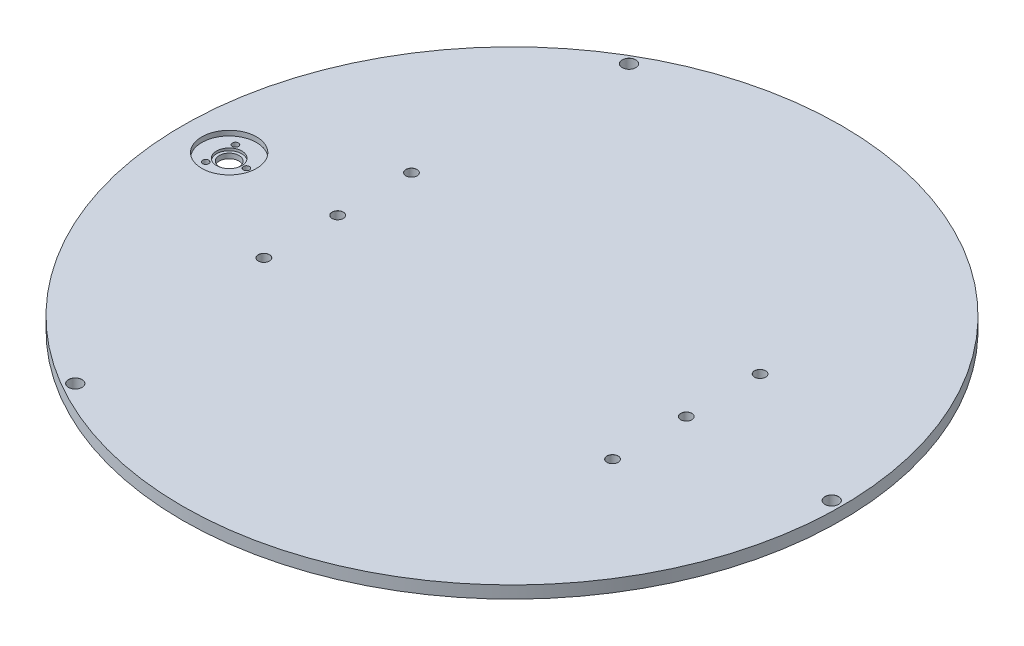
ISO-10303-21;
HEADER;
FILE_DESCRIPTION(('STEP AP214'),'2;1');
FILE_NAME('part.step','',(''),(''),'','','');
FILE_SCHEMA(('AUTOMOTIVE_DESIGN { 1 0 10303 214 1 1 1 1 }'));
ENDSEC;
DATA;
#1=APPLICATION_CONTEXT('core data for automotive mechanical design processes');
#2=APPLICATION_PROTOCOL_DEFINITION('international standard','automotive_design',2000,#1);
#3=PRODUCT_CONTEXT('',#1,'mechanical');
#4=PRODUCT('Part','Part','',(#3));
#5=PRODUCT_RELATED_PRODUCT_CATEGORY('part','',(#4));
#6=PRODUCT_DEFINITION_FORMATION('','',#4);
#7=PRODUCT_DEFINITION_CONTEXT('part definition',#1,'design');
#8=PRODUCT_DEFINITION('design','',#6,#7);
#9=PRODUCT_DEFINITION_SHAPE('','',#8);
#10=(LENGTH_UNIT() NAMED_UNIT(*) SI_UNIT(.MILLI.,.METRE.));
#11=(NAMED_UNIT(*) PLANE_ANGLE_UNIT() SI_UNIT($,.RADIAN.));
#12=(NAMED_UNIT(*) SI_UNIT($,.STERADIAN.) SOLID_ANGLE_UNIT());
#13=UNCERTAINTY_MEASURE_WITH_UNIT(LENGTH_MEASURE(1.E-05),#10,'distance_accuracy_value','');
#14=(GEOMETRIC_REPRESENTATION_CONTEXT(3) GLOBAL_UNCERTAINTY_ASSIGNED_CONTEXT((#13)) GLOBAL_UNIT_ASSIGNED_CONTEXT((#10,
#11,#12)) REPRESENTATION_CONTEXT('',''));
#15=CARTESIAN_POINT('',(0.,0.,0.));
#16=DIRECTION('',(0.,0.,1.));
#17=DIRECTION('',(1.,0.,0.));
#18=AXIS2_PLACEMENT_3D('',#15,#16,#17);
#19=CARTESIAN_POINT('',(0.,0.,0.));
#20=DIRECTION('',(0.,1.,0.));
#21=DIRECTION('',(0.,0.,1.));
#22=AXIS2_PLACEMENT_3D('',#19,#20,#21);
#23=PLANE('',#22);
#24=CARTESIAN_POINT('',(-70.875,0.,30.));
#25=DIRECTION('',(0.,1.,0.));
#26=DIRECTION('',(0.,0.,1.));
#27=AXIS2_PLACEMENT_3D('',#24,#25,#26);
#28=CIRCLE('',#27,2.25);
#29=CARTESIAN_POINT('',(-70.875,0.,32.25));
#30=VERTEX_POINT('',#29);
#31=EDGE_CURVE('E47',#30,#30,#28,.T.);
#32=ORIENTED_EDGE('',*,*,#31,.T.);
#33=EDGE_LOOP('',(#32));
#34=FACE_BOUND('',#33,.T.);
#35=CARTESIAN_POINT('',(-70.875,0.,0.));
#36=DIRECTION('',(0.,1.,0.));
#37=DIRECTION('',(0.,0.,1.));
#38=AXIS2_PLACEMENT_3D('',#35,#36,#37);
#39=CIRCLE('',#38,2.25);
#40=CARTESIAN_POINT('',(-70.875,0.,2.25));
#41=VERTEX_POINT('',#40);
#42=EDGE_CURVE('E109',#41,#41,#39,.T.);
#43=ORIENTED_EDGE('',*,*,#42,.T.);
#44=EDGE_LOOP('',(#43));
#45=FACE_BOUND('',#44,.T.);
#46=CARTESIAN_POINT('',(-70.875,0.,-30.));
#47=DIRECTION('',(0.,1.,0.));
#48=DIRECTION('',(0.,0.,1.));
#49=AXIS2_PLACEMENT_3D('',#46,#47,#48);
#50=CIRCLE('',#49,2.25);
#51=CARTESIAN_POINT('',(-70.875,0.,-27.75));
#52=VERTEX_POINT('',#51);
#53=EDGE_CURVE('E104',#52,#52,#50,.T.);
#54=ORIENTED_EDGE('',*,*,#53,.T.);
#55=EDGE_LOOP('',(#54));
#56=FACE_BOUND('',#55,.T.);
#57=CARTESIAN_POINT('',(70.875,0.,30.));
#58=DIRECTION('',(0.,1.,0.));
#59=DIRECTION('',(0.,0.,1.));
#60=AXIS2_PLACEMENT_3D('',#57,#58,#59);
#61=CIRCLE('',#60,2.25);
#62=CARTESIAN_POINT('',(70.875,0.,32.25));
#63=VERTEX_POINT('',#62);
#64=EDGE_CURVE('E98',#63,#63,#61,.T.);
#65=ORIENTED_EDGE('',*,*,#64,.T.);
#66=EDGE_LOOP('',(#65));
#67=FACE_BOUND('',#66,.T.);
#68=CARTESIAN_POINT('',(70.875,0.,0.));
#69=DIRECTION('',(0.,1.,0.));
#70=DIRECTION('',(0.,0.,1.));
#71=AXIS2_PLACEMENT_3D('',#68,#69,#70);
#72=CIRCLE('',#71,2.25);
#73=CARTESIAN_POINT('',(70.875,0.,2.25));
#74=VERTEX_POINT('',#73);
#75=EDGE_CURVE('E92',#74,#74,#72,.T.);
#76=ORIENTED_EDGE('',*,*,#75,.T.);
#77=EDGE_LOOP('',(#76));
#78=FACE_BOUND('',#77,.T.);
#79=CARTESIAN_POINT('',(70.875,0.,-30.));
#80=DIRECTION('',(0.,1.,0.));
#81=DIRECTION('',(0.,0.,1.));
#82=AXIS2_PLACEMENT_3D('',#79,#80,#81);
#83=CIRCLE('',#82,2.25);
#84=CARTESIAN_POINT('',(70.875,0.,-27.75));
#85=VERTEX_POINT('',#84);
#86=EDGE_CURVE('E86',#85,#85,#83,.T.);
#87=ORIENTED_EDGE('',*,*,#86,.T.);
#88=EDGE_LOOP('',(#87));
#89=FACE_BOUND('',#88,.T.);
#90=CARTESIAN_POINT('',(-65.,0.,-112.583302491977));
#91=DIRECTION('',(0.,1.,0.));
#92=DIRECTION('',(0.,0.,1.));
#93=AXIS2_PLACEMENT_3D('',#90,#91,#92);
#94=CIRCLE('',#93,2.75);
#95=CARTESIAN_POINT('',(-65.,0.,-109.833302491977));
#96=VERTEX_POINT('',#95);
#97=EDGE_CURVE('E80',#96,#96,#94,.T.);
#98=ORIENTED_EDGE('',*,*,#97,.T.);
#99=EDGE_LOOP('',(#98));
#100=FACE_BOUND('',#99,.T.);
#101=CARTESIAN_POINT('',(-65.,0.,112.583302491977));
#102=DIRECTION('',(0.,1.,0.));
#103=DIRECTION('',(0.,0.,1.));
#104=AXIS2_PLACEMENT_3D('',#101,#102,#103);
#105=CIRCLE('',#104,2.75);
#106=CARTESIAN_POINT('',(-65.,0.,115.333302491977));
#107=VERTEX_POINT('',#106);
#108=EDGE_CURVE('E74',#107,#107,#105,.T.);
#109=ORIENTED_EDGE('',*,*,#108,.T.);
#110=EDGE_LOOP('',(#109));
#111=FACE_BOUND('',#110,.T.);
#112=CARTESIAN_POINT('',(130.,0.,0.));
#113=DIRECTION('',(0.,1.,0.));
#114=DIRECTION('',(0.,0.,1.));
#115=AXIS2_PLACEMENT_3D('',#112,#113,#114);
#116=CIRCLE('',#115,2.75);
#117=CARTESIAN_POINT('',(130.,0.,2.75));
#118=VERTEX_POINT('',#117);
#119=EDGE_CURVE('E68',#118,#118,#116,.T.);
#120=ORIENTED_EDGE('',*,*,#119,.T.);
#121=EDGE_LOOP('',(#120));
#122=FACE_BOUND('',#121,.T.);
#123=CARTESIAN_POINT('',(-115.,0.,0.));
#124=DIRECTION('',(0.,-1.,0.));
#125=DIRECTION('',(0.,0.,-1.));
#126=AXIS2_PLACEMENT_3D('',#123,#124,#125);
#127=CIRCLE('',#126,3.99999999999999);
#128=CARTESIAN_POINT('',(-115.,0.,-3.99999999999999));
#129=VERTEX_POINT('',#128);
#130=EDGE_CURVE('E10',#129,#129,#127,.T.);
#131=ORIENTED_EDGE('',*,*,#130,.F.);
#132=EDGE_LOOP('',(#131));
#133=FACE_BOUND('',#132,.T.);
#134=CARTESIAN_POINT('',(-118.5,0.,6.06217782649109));
#135=DIRECTION('',(0.,1.,0.));
#136=DIRECTION('',(0.,0.,1.));
#137=AXIS2_PLACEMENT_3D('',#134,#135,#136);
#138=CIRCLE('',#137,1.25000000000001);
#139=CARTESIAN_POINT('',(-118.5,0.,7.3121778264911));
#140=VERTEX_POINT('',#139);
#141=EDGE_CURVE('E194',#140,#140,#138,.T.);
#142=ORIENTED_EDGE('',*,*,#141,.T.);
#143=EDGE_LOOP('',(#142));
#144=FACE_BOUND('',#143,.T.);
#145=CARTESIAN_POINT('',(-108.,0.,0.));
#146=DIRECTION('',(0.,1.,0.));
#147=DIRECTION('',(0.,0.,1.));
#148=AXIS2_PLACEMENT_3D('',#145,#146,#147);
#149=CIRCLE('',#148,1.25000000000001);
#150=CARTESIAN_POINT('',(-108.,0.,1.25000000000001));
#151=VERTEX_POINT('',#150);
#152=EDGE_CURVE('E186',#151,#151,#149,.T.);
#153=ORIENTED_EDGE('',*,*,#152,.T.);
#154=EDGE_LOOP('',(#153));
#155=FACE_BOUND('',#154,.T.);
#156=CARTESIAN_POINT('',(-118.5,0.,-6.06217782649109));
#157=DIRECTION('',(0.,1.,0.));
#158=DIRECTION('',(0.,0.,1.));
#159=AXIS2_PLACEMENT_3D('',#156,#157,#158);
#160=CIRCLE('',#159,1.25000000000001);
#161=CARTESIAN_POINT('',(-118.5,0.,-4.81217782649107));
#162=VERTEX_POINT('',#161);
#163=EDGE_CURVE('E177',#162,#162,#160,.T.);
#164=ORIENTED_EDGE('',*,*,#163,.T.);
#165=EDGE_LOOP('',(#164));
#166=FACE_BOUND('',#165,.T.);
#167=CARTESIAN_POINT('',(0.,0.,0.));
#168=DIRECTION('',(0.,1.,0.));
#169=DIRECTION('',(0.,0.,1.));
#170=AXIS2_PLACEMENT_3D('',#167,#168,#169);
#171=CIRCLE('',#170,134.);
#172=CARTESIAN_POINT('',(0.,0.,134.));
#173=VERTEX_POINT('',#172);
#174=EDGE_CURVE('E169',#173,#173,#171,.T.);
#175=ORIENTED_EDGE('',*,*,#174,.F.);
#176=EDGE_LOOP('',(#175));
#177=FACE_BOUND('',#176,.T.);
#178=ADVANCED_FACE('F44',(#34,#45,#56,#67,#78,#89,#100,#111,#122,#133,#144,#155,#166,#177),#23,.F.);
#179=CARTESIAN_POINT('',(76.99,5.,26.2747483337139));
#180=DIRECTION('',(0.,1.,0.));
#181=DIRECTION('',(0.,0.,1.));
#182=AXIS2_PLACEMENT_3D('',#179,#180,#181);
#183=PLANE('',#182);
#184=CARTESIAN_POINT('',(-70.875,5.,30.));
#185=DIRECTION('',(0.,1.,0.));
#186=DIRECTION('',(0.,0.,1.));
#187=AXIS2_PLACEMENT_3D('',#184,#185,#186);
#188=CIRCLE('',#187,2.275);
#189=CARTESIAN_POINT('',(-70.875,5.,32.275));
#190=VERTEX_POINT('',#189);
#191=EDGE_CURVE('E516',#190,#190,#188,.T.);
#192=ORIENTED_EDGE('',*,*,#191,.F.);
#193=EDGE_LOOP('',(#192));
#194=FACE_BOUND('',#193,.T.);
#195=CARTESIAN_POINT('',(-70.875,5.,0.));
#196=DIRECTION('',(0.,1.,0.));
#197=DIRECTION('',(0.,0.,1.));
#198=AXIS2_PLACEMENT_3D('',#195,#196,#197);
#199=CIRCLE('',#198,2.275);
#200=CARTESIAN_POINT('',(-70.875,5.,2.275));
#201=VERTEX_POINT('',#200);
#202=EDGE_CURVE('E121',#201,#201,#199,.T.);
#203=ORIENTED_EDGE('',*,*,#202,.F.);
#204=EDGE_LOOP('',(#203));
#205=FACE_BOUND('',#204,.T.);
#206=CARTESIAN_POINT('',(-70.875,5.,-30.));
#207=DIRECTION('',(0.,1.,0.));
#208=DIRECTION('',(0.,0.,1.));
#209=AXIS2_PLACEMENT_3D('',#206,#207,#208);
#210=CIRCLE('',#209,2.275);
#211=CARTESIAN_POINT('',(-70.875,5.,-27.725));
#212=VERTEX_POINT('',#211);
#213=EDGE_CURVE('E112',#212,#212,#210,.T.);
#214=ORIENTED_EDGE('',*,*,#213,.F.);
#215=EDGE_LOOP('',(#214));
#216=FACE_BOUND('',#215,.T.);
#217=CARTESIAN_POINT('',(70.875,5.,30.));
#218=DIRECTION('',(0.,1.,0.));
#219=DIRECTION('',(0.,0.,1.));
#220=AXIS2_PLACEMENT_3D('',#217,#218,#219);
#221=CIRCLE('',#220,2.275);
#222=CARTESIAN_POINT('',(70.875,5.,32.275));
#223=VERTEX_POINT('',#222);
#224=EDGE_CURVE('E107',#223,#223,#221,.T.);
#225=ORIENTED_EDGE('',*,*,#224,.F.);
#226=EDGE_LOOP('',(#225));
#227=FACE_BOUND('',#226,.T.);
#228=CARTESIAN_POINT('',(70.875,5.,0.));
#229=DIRECTION('',(0.,1.,0.));
#230=DIRECTION('',(0.,0.,1.));
#231=AXIS2_PLACEMENT_3D('',#228,#229,#230);
#232=CIRCLE('',#231,2.275);
#233=CARTESIAN_POINT('',(70.875,5.,2.275));
#234=VERTEX_POINT('',#233);
#235=EDGE_CURVE('E102',#234,#234,#232,.T.);
#236=ORIENTED_EDGE('',*,*,#235,.F.);
#237=EDGE_LOOP('',(#236));
#238=FACE_BOUND('',#237,.T.);
#239=CARTESIAN_POINT('',(70.875,5.,-30.));
#240=DIRECTION('',(0.,1.,0.));
#241=DIRECTION('',(0.,0.,1.));
#242=AXIS2_PLACEMENT_3D('',#239,#240,#241);
#243=CIRCLE('',#242,2.275);
#244=CARTESIAN_POINT('',(70.875,5.,-27.725));
#245=VERTEX_POINT('',#244);
#246=EDGE_CURVE('E96',#245,#245,#243,.T.);
#247=ORIENTED_EDGE('',*,*,#246,.F.);
#248=EDGE_LOOP('',(#247));
#249=FACE_BOUND('',#248,.T.);
#250=CARTESIAN_POINT('',(-65.,5.,-112.583302491977));
#251=DIRECTION('',(0.,1.,0.));
#252=DIRECTION('',(0.,0.,1.));
#253=AXIS2_PLACEMENT_3D('',#250,#251,#252);
#254=CIRCLE('',#253,2.775);
#255=CARTESIAN_POINT('',(-65.,5.,-109.808302491977));
#256=VERTEX_POINT('',#255);
#257=EDGE_CURVE('E90',#256,#256,#254,.T.);
#258=ORIENTED_EDGE('',*,*,#257,.F.);
#259=EDGE_LOOP('',(#258));
#260=FACE_BOUND('',#259,.T.);
#261=CARTESIAN_POINT('',(-65.,5.,112.583302491977));
#262=DIRECTION('',(0.,1.,0.));
#263=DIRECTION('',(0.,0.,1.));
#264=AXIS2_PLACEMENT_3D('',#261,#262,#263);
#265=CIRCLE('',#264,2.775);
#266=CARTESIAN_POINT('',(-65.,5.,115.358302491977));
#267=VERTEX_POINT('',#266);
#268=EDGE_CURVE('E84',#267,#267,#265,.T.);
#269=ORIENTED_EDGE('',*,*,#268,.F.);
#270=EDGE_LOOP('',(#269));
#271=FACE_BOUND('',#270,.T.);
#272=CARTESIAN_POINT('',(130.,5.,0.));
#273=DIRECTION('',(0.,1.,0.));
#274=DIRECTION('',(0.,0.,1.));
#275=AXIS2_PLACEMENT_3D('',#272,#273,#274);
#276=CIRCLE('',#275,2.775);
#277=CARTESIAN_POINT('',(130.,5.,2.775));
#278=VERTEX_POINT('',#277);
#279=EDGE_CURVE('E78',#278,#278,#276,.T.);
#280=ORIENTED_EDGE('',*,*,#279,.F.);
#281=EDGE_LOOP('',(#280));
#282=FACE_BOUND('',#281,.T.);
#283=CARTESIAN_POINT('',(-115.,5.,0.));
#284=DIRECTION('',(0.,1.,0.));
#285=DIRECTION('',(0.,0.,1.));
#286=AXIS2_PLACEMENT_3D('',#283,#284,#285);
#287=CIRCLE('',#286,11.125);
#288=CARTESIAN_POINT('',(-115.,5.,11.125));
#289=VERTEX_POINT('',#288);
#290=EDGE_CURVE('E181',#289,#289,#287,.T.);
#291=ORIENTED_EDGE('',*,*,#290,.F.);
#292=EDGE_LOOP('',(#291));
#293=FACE_BOUND('',#292,.T.);
#294=CARTESIAN_POINT('',(0.,5.,0.));
#295=DIRECTION('',(0.,1.,0.));
#296=DIRECTION('',(0.,0.,1.));
#297=AXIS2_PLACEMENT_3D('',#294,#295,#296);
#298=CIRCLE('',#297,134.);
#299=CARTESIAN_POINT('',(0.,5.,134.));
#300=VERTEX_POINT('',#299);
#301=EDGE_CURVE('E72',#300,#300,#298,.T.);
#302=ORIENTED_EDGE('',*,*,#301,.T.);
#303=EDGE_LOOP('',(#302));
#304=FACE_BOUND('',#303,.T.);
#305=ADVANCED_FACE('F209',(#194,#205,#216,#227,#238,#249,#260,#271,#282,#293,#304),#183,.T.);
#306=CARTESIAN_POINT('',(-115.,2.,0.));
#307=DIRECTION('',(0.,1.,0.));
#308=DIRECTION('',(0.,0.,1.));
#309=AXIS2_PLACEMENT_3D('',#306,#307,#308);
#310=CYLINDRICAL_SURFACE('',#309,5.14999999999998);
#311=CARTESIAN_POINT('',(-115.,2.,0.));
#312=DIRECTION('',(0.,1.,0.));
#313=DIRECTION('',(0.,0.,1.));
#314=AXIS2_PLACEMENT_3D('',#311,#312,#313);
#315=CIRCLE('',#314,5.14999999999998);
#316=CARTESIAN_POINT('',(-115.,2.,5.14999999999998));
#317=VERTEX_POINT('',#316);
#318=EDGE_CURVE('E58',#317,#317,#315,.T.);
#319=ORIENTED_EDGE('',*,*,#318,.F.);
#320=EDGE_LOOP('',(#319));
#321=FACE_BOUND('',#320,.T.);
#322=CARTESIAN_POINT('',(-115.,3.,0.));
#323=DIRECTION('',(0.,1.,0.));
#324=DIRECTION('',(0.,0.,1.));
#325=AXIS2_PLACEMENT_3D('',#322,#323,#324);
#326=CIRCLE('',#325,5.14999999999998);
#327=CARTESIAN_POINT('',(-115.,3.,5.14999999999998));
#328=VERTEX_POINT('',#327);
#329=EDGE_CURVE('E63',#328,#328,#326,.F.);
#330=ORIENTED_EDGE('',*,*,#329,.F.);
#331=EDGE_LOOP('',(#330));
#332=FACE_BOUND('',#331,.T.);
#333=ADVANCED_FACE('F212',(#321,#332),#310,.F.);
#334=CARTESIAN_POINT('',(-115.,34.4580685042316,0.));
#335=DIRECTION('',(0.,-1.,0.));
#336=DIRECTION('',(0.,0.,-1.));
#337=AXIS2_PLACEMENT_3D('',#334,#335,#336);
#338=CYLINDRICAL_SURFACE('',#337,3.99999999999999);
#339=CARTESIAN_POINT('',(-115.,2.,0.));
#340=DIRECTION('',(0.,1.,0.));
#341=DIRECTION('',(0.,0.,1.));
#342=AXIS2_PLACEMENT_3D('',#339,#340,#341);
#343=CIRCLE('',#342,3.99999999999999);
#344=CARTESIAN_POINT('',(-115.,1.99999999999999,-3.99999999999999));
#345=VERTEX_POINT('',#344);
#346=EDGE_CURVE('E52',#345,#345,#343,.F.);
#347=CARTESIAN_POINT('',(-115.,0.,-3.99999999999999));
#348=CARTESIAN_POINT('',(-115.,0.0208333333333403,-3.99999999999999));
#349=CARTESIAN_POINT('',(-115.,0.0416666666666736,-3.99999999999999));
#350=CARTESIAN_POINT('',(-115.,0.0833333333333404,-3.99999999999999));
#351=CARTESIAN_POINT('',(-115.,0.104166666666674,-3.99999999999999));
#352=CARTESIAN_POINT('',(-115.,0.14583333333334,-3.99999999999999));
#353=CARTESIAN_POINT('',(-115.,0.166666666666674,-3.99999999999999));
#354=CARTESIAN_POINT('',(-115.,0.20833333333334,-3.99999999999999));
#355=CARTESIAN_POINT('',(-115.,0.229166666666674,-3.99999999999999));
#356=CARTESIAN_POINT('',(-115.,0.270833333333341,-3.99999999999999));
#357=CARTESIAN_POINT('',(-115.,0.291666666666674,-3.99999999999999));
#358=CARTESIAN_POINT('',(-115.,0.333333333333341,-3.99999999999999));
#359=CARTESIAN_POINT('',(-115.,0.354166666666674,-3.99999999999999));
#360=CARTESIAN_POINT('',(-115.,0.395833333333341,-3.99999999999999));
#361=CARTESIAN_POINT('',(-115.,0.416666666666674,-3.99999999999999));
#362=CARTESIAN_POINT('',(-115.,0.458333333333341,-3.99999999999999));
#363=CARTESIAN_POINT('',(-115.,0.479166666666674,-3.99999999999999));
#364=CARTESIAN_POINT('',(-115.,0.520833333333338,-3.99999999999999));
#365=CARTESIAN_POINT('',(-115.,0.541666666666669,-3.99999999999999));
#366=CARTESIAN_POINT('',(-115.,0.583333333333334,-3.99999999999999));
#367=CARTESIAN_POINT('',(-115.,0.604166666666667,-3.99999999999999));
#368=CARTESIAN_POINT('',(-115.,0.645833333333334,-3.99999999999999));
#369=CARTESIAN_POINT('',(-115.,0.666666666666667,-3.99999999999999));
#370=CARTESIAN_POINT('',(-115.,0.708333333333334,-3.99999999999999));
#371=CARTESIAN_POINT('',(-115.,0.729166666666667,-3.99999999999999));
#372=CARTESIAN_POINT('',(-115.,0.770833333333334,-3.99999999999999));
#373=CARTESIAN_POINT('',(-115.,0.791666666666667,-3.99999999999999));
#374=CARTESIAN_POINT('',(-115.,0.833333333333334,-3.99999999999999));
#375=CARTESIAN_POINT('',(-115.,0.854166666666667,-3.99999999999999));
#376=CARTESIAN_POINT('',(-115.,0.895833333333334,-3.99999999999999));
#377=CARTESIAN_POINT('',(-115.,0.916666666666668,-3.99999999999999));
#378=CARTESIAN_POINT('',(-115.,0.958333333333334,-3.99999999999999));
#379=CARTESIAN_POINT('',(-115.,0.979166666666668,-3.99999999999999));
#380=CARTESIAN_POINT('',(-115.,1.02083333333333,-3.99999999999999));
#381=CARTESIAN_POINT('',(-115.,1.04166666666667,-3.99999999999999));
#382=CARTESIAN_POINT('',(-115.,1.08333333333333,-3.99999999999999));
#383=CARTESIAN_POINT('',(-115.,1.10416666666667,-3.99999999999999));
#384=CARTESIAN_POINT('',(-115.,1.14583333333333,-3.99999999999999));
#385=CARTESIAN_POINT('',(-115.,1.16666666666667,-3.99999999999999));
#386=CARTESIAN_POINT('',(-115.,1.20833333333333,-3.99999999999999));
#387=CARTESIAN_POINT('',(-115.,1.22916666666667,-3.99999999999999));
#388=CARTESIAN_POINT('',(-115.,1.27083333333333,-3.99999999999999));
#389=CARTESIAN_POINT('',(-115.,1.29166666666667,-3.99999999999999));
#390=CARTESIAN_POINT('',(-115.,1.33333333333333,-3.99999999999999));
#391=CARTESIAN_POINT('',(-115.,1.35416666666667,-3.99999999999999));
#392=CARTESIAN_POINT('',(-115.,1.39583333333333,-3.99999999999999));
#393=CARTESIAN_POINT('',(-115.,1.41666666666667,-3.99999999999999));
#394=CARTESIAN_POINT('',(-115.,1.45833333333333,-3.99999999999999));
#395=CARTESIAN_POINT('',(-115.,1.47916666666666,-3.99999999999999));
#396=CARTESIAN_POINT('',(-115.,1.52083333333333,-3.99999999999999));
#397=CARTESIAN_POINT('',(-115.,1.54166666666666,-3.99999999999999));
#398=CARTESIAN_POINT('',(-115.,1.58333333333333,-3.99999999999999));
#399=CARTESIAN_POINT('',(-115.,1.60416666666666,-3.99999999999999));
#400=CARTESIAN_POINT('',(-115.,1.64583333333333,-3.99999999999999));
#401=CARTESIAN_POINT('',(-115.,1.66666666666666,-3.99999999999999));
#402=CARTESIAN_POINT('',(-115.,1.70833333333333,-3.99999999999999));
#403=CARTESIAN_POINT('',(-115.,1.72916666666666,-3.99999999999999));
#404=CARTESIAN_POINT('',(-115.,1.77083333333333,-3.99999999999999));
#405=CARTESIAN_POINT('',(-115.,1.79166666666666,-3.99999999999999));
#406=CARTESIAN_POINT('',(-115.,1.83333333333333,-3.99999999999999));
#407=CARTESIAN_POINT('',(-115.,1.85416666666666,-3.99999999999999));
#408=CARTESIAN_POINT('',(-115.,1.89583333333333,-3.99999999999999));
#409=CARTESIAN_POINT('',(-115.,1.91666666666666,-3.99999999999999));
#410=CARTESIAN_POINT('',(-115.,1.95833333333333,-3.99999999999999));
#411=CARTESIAN_POINT('',(-115.,1.97916666666666,-3.99999999999999));
#412=CARTESIAN_POINT('',(-115.,1.99999999999999,-3.99999999999999));
#413=B_SPLINE_CURVE_WITH_KNOTS('',3,(#347,#348,#349,#350,#351,#352,#353,#354,#355,#356,#357,
#358,#359,#360,#361,#362,#363,#364,#365,#366,#367,#368,#369,#370,#371,#372,#373,#374,#375,#376,
#377,#378,#379,#380,#381,#382,#383,#384,#385,#386,#387,#388,#389,#390,#391,#392,#393,#394,#395,
#396,#397,#398,#399,#400,#401,#402,#403,#404,#405,#406,#407,#408,#409,#410,#411,#412),
.UNSPECIFIED.,.F.,.F.,(4,2,2,2,2,2,2,2,2,2,2,2,2,2,2,2,2,2,2,2,2,2,2,2,2,2,2,2,2,2,2,2,4),(0.,
0.0625000000000001,0.125,0.1875,0.25,0.3125,0.375,0.4375,0.5,0.562499999999994,
0.624999999999994,0.687499999999994,0.749999999999994,0.812499999999994,0.874999999999994,
0.937499999999994,0.999999999999994,1.06249999999999,1.12499999999999,1.18749999999999,
1.24999999999999,1.31249999999999,1.37499999999999,1.43749999999999,1.49999999999999,
1.56249999999999,1.62499999999999,1.68749999999999,1.74999999999999,1.81249999999999,
1.87499999999999,1.93749999999999,1.99999999999999),.UNSPECIFIED.);
#414=EDGE_CURVE('BSEAM279',#129,#345,#413,.T.);
#415=ORIENTED_EDGE('',*,*,#130,.T.);
#416=ORIENTED_EDGE('',*,*,#346,.F.);
#417=ORIENTED_EDGE('',*,*,#414,.T.);
#418=ORIENTED_EDGE('',*,*,#414,.F.);
#419=EDGE_LOOP('',(#415,#417,#416,#418));
#420=FACE_BOUND('',#419,.T.);
#421=ADVANCED_FACE('F279',(#420),#338,.F.);
#422=CARTESIAN_POINT('',(-115.,2.,0.));
#423=DIRECTION('',(0.,1.,0.));
#424=DIRECTION('',(0.,0.,1.));
#425=AXIS2_PLACEMENT_3D('',#422,#423,#424);
#426=PLANE('',#425);
#427=ORIENTED_EDGE('',*,*,#318,.T.);
#428=EDGE_LOOP('',(#427));
#429=FACE_BOUND('',#428,.T.);
#430=ORIENTED_EDGE('',*,*,#346,.T.);
#431=EDGE_LOOP('',(#430));
#432=FACE_BOUND('',#431,.T.);
#433=ADVANCED_FACE('F268',(#429,#432),#426,.T.);
#434=CARTESIAN_POINT('',(-115.,3.,0.));
#435=DIRECTION('',(0.,1.,0.));
#436=DIRECTION('',(0.,0.,1.));
#437=AXIS2_PLACEMENT_3D('',#434,#435,#436);
#438=PLANE('',#437);
#439=CARTESIAN_POINT('',(-118.5,3.,-6.06217782649109));
#440=DIRECTION('',(0.,1.,0.));
#441=DIRECTION('',(0.,0.,1.));
#442=AXIS2_PLACEMENT_3D('',#439,#440,#441);
#443=CIRCLE('',#442,1.25000000000001);
#444=CARTESIAN_POINT('',(-118.5,3.,-4.81217782649107));
#445=VERTEX_POINT('',#444);
#446=EDGE_CURVE('E182',#445,#445,#443,.T.);
#447=ORIENTED_EDGE('',*,*,#446,.F.);
#448=EDGE_LOOP('',(#447));
#449=FACE_BOUND('',#448,.T.);
#450=CARTESIAN_POINT('',(-108.,3.,0.));
#451=DIRECTION('',(0.,1.,0.));
#452=DIRECTION('',(0.,0.,1.));
#453=AXIS2_PLACEMENT_3D('',#450,#451,#452);
#454=CIRCLE('',#453,1.25000000000001);
#455=CARTESIAN_POINT('',(-108.,3.,1.25000000000001));
#456=VERTEX_POINT('',#455);
#457=EDGE_CURVE('E190',#456,#456,#454,.T.);
#458=ORIENTED_EDGE('',*,*,#457,.F.);
#459=EDGE_LOOP('',(#458));
#460=FACE_BOUND('',#459,.T.);
#461=CARTESIAN_POINT('',(-118.5,3.,6.06217782649109));
#462=DIRECTION('',(0.,1.,0.));
#463=DIRECTION('',(0.,0.,1.));
#464=AXIS2_PLACEMENT_3D('',#461,#462,#463);
#465=CIRCLE('',#464,1.25000000000001);
#466=CARTESIAN_POINT('',(-118.5,3.,7.3121778264911));
#467=VERTEX_POINT('',#466);
#468=EDGE_CURVE('E173',#467,#467,#465,.T.);
#469=ORIENTED_EDGE('',*,*,#468,.F.);
#470=EDGE_LOOP('',(#469));
#471=FACE_BOUND('',#470,.T.);
#472=CARTESIAN_POINT('',(-115.,3.,0.));
#473=DIRECTION('',(0.,1.,0.));
#474=DIRECTION('',(0.,0.,1.));
#475=AXIS2_PLACEMENT_3D('',#472,#473,#474);
#476=CIRCLE('',#475,11.125);
#477=CARTESIAN_POINT('',(-115.,3.,11.125));
#478=VERTEX_POINT('',#477);
#479=EDGE_CURVE('E67',#478,#478,#476,.T.);
#480=ORIENTED_EDGE('',*,*,#479,.T.);
#481=EDGE_LOOP('',(#480));
#482=FACE_BOUND('',#481,.T.);
#483=ORIENTED_EDGE('',*,*,#329,.T.);
#484=EDGE_LOOP('',(#483));
#485=FACE_BOUND('',#484,.T.);
#486=ADVANCED_FACE('F265',(#449,#460,#471,#482,#485),#438,.T.);
#487=CARTESIAN_POINT('',(-115.,3.,0.));
#488=DIRECTION('',(0.,1.,0.));
#489=DIRECTION('',(0.,0.,1.));
#490=AXIS2_PLACEMENT_3D('',#487,#488,#489);
#491=CYLINDRICAL_SURFACE('',#490,11.125);
#492=ORIENTED_EDGE('',*,*,#479,.F.);
#493=EDGE_LOOP('',(#492));
#494=FACE_BOUND('',#493,.T.);
#495=ORIENTED_EDGE('',*,*,#290,.T.);
#496=EDGE_LOOP('',(#495));
#497=FACE_BOUND('',#496,.T.);
#498=ADVANCED_FACE('F207',(#494,#497),#491,.F.);
#499=CARTESIAN_POINT('',(-118.5,0.,6.06217782649109));
#500=DIRECTION('',(0.,1.,0.));
#501=DIRECTION('',(0.,0.,1.));
#502=AXIS2_PLACEMENT_3D('',#499,#500,#501);
#503=CYLINDRICAL_SURFACE('',#502,1.25000000000001);
#504=ORIENTED_EDGE('',*,*,#141,.F.);
#505=EDGE_LOOP('',(#504));
#506=FACE_BOUND('',#505,.T.);
#507=ORIENTED_EDGE('',*,*,#468,.T.);
#508=EDGE_LOOP('',(#507));
#509=FACE_BOUND('',#508,.T.);
#510=ADVANCED_FACE('F292',(#506,#509),#503,.F.);
#511=CARTESIAN_POINT('',(-108.,0.,0.));
#512=DIRECTION('',(0.,1.,0.));
#513=DIRECTION('',(0.,0.,1.));
#514=AXIS2_PLACEMENT_3D('',#511,#512,#513);
#515=CYLINDRICAL_SURFACE('',#514,1.25000000000001);
#516=ORIENTED_EDGE('',*,*,#152,.F.);
#517=EDGE_LOOP('',(#516));
#518=FACE_BOUND('',#517,.T.);
#519=ORIENTED_EDGE('',*,*,#457,.T.);
#520=EDGE_LOOP('',(#519));
#521=FACE_BOUND('',#520,.T.);
#522=ADVANCED_FACE('F229',(#518,#521),#515,.F.);
#523=CARTESIAN_POINT('',(-118.5,0.,-6.06217782649109));
#524=DIRECTION('',(0.,1.,0.));
#525=DIRECTION('',(0.,0.,1.));
#526=AXIS2_PLACEMENT_3D('',#523,#524,#525);
#527=CYLINDRICAL_SURFACE('',#526,1.25000000000001);
#528=ORIENTED_EDGE('',*,*,#163,.F.);
#529=EDGE_LOOP('',(#528));
#530=FACE_BOUND('',#529,.T.);
#531=ORIENTED_EDGE('',*,*,#446,.T.);
#532=EDGE_LOOP('',(#531));
#533=FACE_BOUND('',#532,.T.);
#534=ADVANCED_FACE('F219',(#530,#533),#527,.F.);
#535=CARTESIAN_POINT('',(0.,0.,0.));
#536=DIRECTION('',(0.,1.,0.));
#537=DIRECTION('',(0.,0.,1.));
#538=AXIS2_PLACEMENT_3D('',#535,#536,#537);
#539=CYLINDRICAL_SURFACE('',#538,134.);
#540=ORIENTED_EDGE('',*,*,#174,.T.);
#541=EDGE_LOOP('',(#540));
#542=FACE_BOUND('',#541,.T.);
#543=ORIENTED_EDGE('',*,*,#301,.F.);
#544=EDGE_LOOP('',(#543));
#545=FACE_BOUND('',#544,.T.);
#546=ADVANCED_FACE('F216',(#542,#545),#539,.T.);
#547=CARTESIAN_POINT('',(130.,5.,0.));
#548=DIRECTION('',(0.,1.,0.));
#549=DIRECTION('',(0.,0.,1.));
#550=AXIS2_PLACEMENT_3D('',#547,#548,#549);
#551=CYLINDRICAL_SURFACE('',#550,2.75);
#552=CARTESIAN_POINT('',(130.,4.975,0.));
#553=DIRECTION('',(0.,1.,0.));
#554=DIRECTION('',(0.,0.,1.));
#555=AXIS2_PLACEMENT_3D('',#552,#553,#554);
#556=CIRCLE('',#555,2.75);
#557=CARTESIAN_POINT('',(130.,4.975,2.75));
#558=VERTEX_POINT('',#557);
#559=EDGE_CURVE('E73',#558,#558,#556,.T.);
#560=ORIENTED_EDGE('',*,*,#559,.T.);
#561=EDGE_LOOP('',(#560));
#562=FACE_BOUND('',#561,.T.);
#563=ORIENTED_EDGE('',*,*,#119,.F.);
#564=EDGE_LOOP('',(#563));
#565=FACE_BOUND('',#564,.T.);
#566=ADVANCED_FACE('F218',(#562,#565),#551,.F.);
#567=CARTESIAN_POINT('',(130.,5.,0.));
#568=DIRECTION('',(0.,1.,0.));
#569=DIRECTION('',(0.,0.,1.));
#570=AXIS2_PLACEMENT_3D('',#567,#568,#569);
#571=CONICAL_SURFACE('',#570,2.775,0.785398163397344);
#572=ORIENTED_EDGE('',*,*,#559,.F.);
#573=EDGE_LOOP('',(#572));
#574=FACE_BOUND('',#573,.T.);
#575=ORIENTED_EDGE('',*,*,#279,.T.);
#576=EDGE_LOOP('',(#575));
#577=FACE_BOUND('',#576,.T.);
#578=ADVANCED_FACE('F226',(#574,#577),#571,.F.);
#579=CARTESIAN_POINT('',(-65.,5.,112.583302491977));
#580=DIRECTION('',(0.,1.,0.));
#581=DIRECTION('',(0.,0.,1.));
#582=AXIS2_PLACEMENT_3D('',#579,#580,#581);
#583=CYLINDRICAL_SURFACE('',#582,2.75);
#584=CARTESIAN_POINT('',(-65.,4.975,112.583302491977));
#585=DIRECTION('',(0.,1.,0.));
#586=DIRECTION('',(0.,0.,1.));
#587=AXIS2_PLACEMENT_3D('',#584,#585,#586);
#588=CIRCLE('',#587,2.75);
#589=CARTESIAN_POINT('',(-65.,4.975,115.333302491977));
#590=VERTEX_POINT('',#589);
#591=EDGE_CURVE('E79',#590,#590,#588,.T.);
#592=ORIENTED_EDGE('',*,*,#591,.T.);
#593=EDGE_LOOP('',(#592));
#594=FACE_BOUND('',#593,.T.);
#595=ORIENTED_EDGE('',*,*,#108,.F.);
#596=EDGE_LOOP('',(#595));
#597=FACE_BOUND('',#596,.T.);
#598=ADVANCED_FACE('F349',(#594,#597),#583,.F.);
#599=CARTESIAN_POINT('',(-65.,5.,112.583302491977));
#600=DIRECTION('',(0.,1.,0.));
#601=DIRECTION('',(0.,0.,1.));
#602=AXIS2_PLACEMENT_3D('',#599,#600,#601);
#603=CONICAL_SURFACE('',#602,2.775,0.785398163397344);
#604=ORIENTED_EDGE('',*,*,#591,.F.);
#605=EDGE_LOOP('',(#604));
#606=FACE_BOUND('',#605,.T.);
#607=ORIENTED_EDGE('',*,*,#268,.T.);
#608=EDGE_LOOP('',(#607));
#609=FACE_BOUND('',#608,.T.);
#610=ADVANCED_FACE('F359',(#606,#609),#603,.F.);
#611=CARTESIAN_POINT('',(-65.,5.,-112.583302491977));
#612=DIRECTION('',(0.,1.,0.));
#613=DIRECTION('',(0.,0.,1.));
#614=AXIS2_PLACEMENT_3D('',#611,#612,#613);
#615=CYLINDRICAL_SURFACE('',#614,2.75);
#616=CARTESIAN_POINT('',(-65.,4.975,-112.583302491977));
#617=DIRECTION('',(0.,1.,0.));
#618=DIRECTION('',(0.,0.,1.));
#619=AXIS2_PLACEMENT_3D('',#616,#617,#618);
#620=CIRCLE('',#619,2.75);
#621=CARTESIAN_POINT('',(-65.,4.975,-109.833302491977));
#622=VERTEX_POINT('',#621);
#623=EDGE_CURVE('E85',#622,#622,#620,.T.);
#624=ORIENTED_EDGE('',*,*,#623,.T.);
#625=EDGE_LOOP('',(#624));
#626=FACE_BOUND('',#625,.T.);
#627=ORIENTED_EDGE('',*,*,#97,.F.);
#628=EDGE_LOOP('',(#627));
#629=FACE_BOUND('',#628,.T.);
#630=ADVANCED_FACE('F369',(#626,#629),#615,.F.);
#631=CARTESIAN_POINT('',(-65.,5.,-112.583302491977));
#632=DIRECTION('',(0.,1.,0.));
#633=DIRECTION('',(0.,0.,1.));
#634=AXIS2_PLACEMENT_3D('',#631,#632,#633);
#635=CONICAL_SURFACE('',#634,2.775,0.785398163397344);
#636=ORIENTED_EDGE('',*,*,#623,.F.);
#637=EDGE_LOOP('',(#636));
#638=FACE_BOUND('',#637,.T.);
#639=ORIENTED_EDGE('',*,*,#257,.T.);
#640=EDGE_LOOP('',(#639));
#641=FACE_BOUND('',#640,.T.);
#642=ADVANCED_FACE('F379',(#638,#641),#635,.F.);
#643=CARTESIAN_POINT('',(70.875,5.,-30.));
#644=DIRECTION('',(0.,1.,0.));
#645=DIRECTION('',(0.,0.,1.));
#646=AXIS2_PLACEMENT_3D('',#643,#644,#645);
#647=CYLINDRICAL_SURFACE('',#646,2.25);
#648=CARTESIAN_POINT('',(70.875,4.975,-30.));
#649=DIRECTION('',(0.,1.,0.));
#650=DIRECTION('',(0.,0.,1.));
#651=AXIS2_PLACEMENT_3D('',#648,#649,#650);
#652=CIRCLE('',#651,2.25);
#653=CARTESIAN_POINT('',(70.875,4.975,-27.75));
#654=VERTEX_POINT('',#653);
#655=EDGE_CURVE('E91',#654,#654,#652,.T.);
#656=ORIENTED_EDGE('',*,*,#655,.T.);
#657=EDGE_LOOP('',(#656));
#658=FACE_BOUND('',#657,.T.);
#659=ORIENTED_EDGE('',*,*,#86,.F.);
#660=EDGE_LOOP('',(#659));
#661=FACE_BOUND('',#660,.T.);
#662=ADVANCED_FACE('F388',(#658,#661),#647,.F.);
#663=CARTESIAN_POINT('',(70.875,5.,-30.));
#664=DIRECTION('',(0.,1.,0.));
#665=DIRECTION('',(0.,0.,1.));
#666=AXIS2_PLACEMENT_3D('',#663,#664,#665);
#667=CONICAL_SURFACE('',#666,2.275,0.785398163397431);
#668=ORIENTED_EDGE('',*,*,#655,.F.);
#669=EDGE_LOOP('',(#668));
#670=FACE_BOUND('',#669,.T.);
#671=ORIENTED_EDGE('',*,*,#246,.T.);
#672=EDGE_LOOP('',(#671));
#673=FACE_BOUND('',#672,.T.);
#674=ADVANCED_FACE('F398',(#670,#673),#667,.F.);
#675=CARTESIAN_POINT('',(70.875,5.,0.));
#676=DIRECTION('',(0.,1.,0.));
#677=DIRECTION('',(0.,0.,1.));
#678=AXIS2_PLACEMENT_3D('',#675,#676,#677);
#679=CYLINDRICAL_SURFACE('',#678,2.25);
#680=CARTESIAN_POINT('',(70.875,4.975,0.));
#681=DIRECTION('',(0.,1.,0.));
#682=DIRECTION('',(0.,0.,1.));
#683=AXIS2_PLACEMENT_3D('',#680,#681,#682);
#684=CIRCLE('',#683,2.25);
#685=CARTESIAN_POINT('',(70.875,4.975,2.25));
#686=VERTEX_POINT('',#685);
#687=EDGE_CURVE('E97',#686,#686,#684,.T.);
#688=ORIENTED_EDGE('',*,*,#687,.T.);
#689=EDGE_LOOP('',(#688));
#690=FACE_BOUND('',#689,.T.);
#691=ORIENTED_EDGE('',*,*,#75,.F.);
#692=EDGE_LOOP('',(#691));
#693=FACE_BOUND('',#692,.T.);
#694=ADVANCED_FACE('F408',(#690,#693),#679,.F.);
#695=CARTESIAN_POINT('',(70.875,5.,0.));
#696=DIRECTION('',(0.,1.,0.));
#697=DIRECTION('',(0.,0.,1.));
#698=AXIS2_PLACEMENT_3D('',#695,#696,#697);
#699=CONICAL_SURFACE('',#698,2.275,0.785398163397431);
#700=ORIENTED_EDGE('',*,*,#687,.F.);
#701=EDGE_LOOP('',(#700));
#702=FACE_BOUND('',#701,.T.);
#703=ORIENTED_EDGE('',*,*,#235,.T.);
#704=EDGE_LOOP('',(#703));
#705=FACE_BOUND('',#704,.T.);
#706=ADVANCED_FACE('F418',(#702,#705),#699,.F.);
#707=CARTESIAN_POINT('',(70.875,5.,30.));
#708=DIRECTION('',(0.,1.,0.));
#709=DIRECTION('',(0.,0.,1.));
#710=AXIS2_PLACEMENT_3D('',#707,#708,#709);
#711=CYLINDRICAL_SURFACE('',#710,2.25);
#712=CARTESIAN_POINT('',(70.875,4.975,30.));
#713=DIRECTION('',(0.,1.,0.));
#714=DIRECTION('',(0.,0.,1.));
#715=AXIS2_PLACEMENT_3D('',#712,#713,#714);
#716=CIRCLE('',#715,2.25);
#717=CARTESIAN_POINT('',(70.875,4.975,32.25));
#718=VERTEX_POINT('',#717);
#719=EDGE_CURVE('E103',#718,#718,#716,.T.);
#720=ORIENTED_EDGE('',*,*,#719,.T.);
#721=EDGE_LOOP('',(#720));
#722=FACE_BOUND('',#721,.T.);
#723=ORIENTED_EDGE('',*,*,#64,.F.);
#724=EDGE_LOOP('',(#723));
#725=FACE_BOUND('',#724,.T.);
#726=ADVANCED_FACE('F428',(#722,#725),#711,.F.);
#727=CARTESIAN_POINT('',(70.875,5.,30.));
#728=DIRECTION('',(0.,1.,0.));
#729=DIRECTION('',(0.,0.,1.));
#730=AXIS2_PLACEMENT_3D('',#727,#728,#729);
#731=CONICAL_SURFACE('',#730,2.275,0.785398163397431);
#732=ORIENTED_EDGE('',*,*,#719,.F.);
#733=EDGE_LOOP('',(#732));
#734=FACE_BOUND('',#733,.T.);
#735=ORIENTED_EDGE('',*,*,#224,.T.);
#736=EDGE_LOOP('',(#735));
#737=FACE_BOUND('',#736,.T.);
#738=ADVANCED_FACE('F438',(#734,#737),#731,.F.);
#739=CARTESIAN_POINT('',(-70.875,5.,-30.));
#740=DIRECTION('',(0.,1.,0.));
#741=DIRECTION('',(0.,0.,1.));
#742=AXIS2_PLACEMENT_3D('',#739,#740,#741);
#743=CYLINDRICAL_SURFACE('',#742,2.25);
#744=CARTESIAN_POINT('',(-70.875,4.975,-30.));
#745=DIRECTION('',(0.,1.,0.));
#746=DIRECTION('',(0.,0.,1.));
#747=AXIS2_PLACEMENT_3D('',#744,#745,#746);
#748=CIRCLE('',#747,2.25);
#749=CARTESIAN_POINT('',(-70.875,4.975,-27.75));
#750=VERTEX_POINT('',#749);
#751=EDGE_CURVE('E108',#750,#750,#748,.T.);
#752=ORIENTED_EDGE('',*,*,#751,.T.);
#753=EDGE_LOOP('',(#752));
#754=FACE_BOUND('',#753,.T.);
#755=ORIENTED_EDGE('',*,*,#53,.F.);
#756=EDGE_LOOP('',(#755));
#757=FACE_BOUND('',#756,.T.);
#758=ADVANCED_FACE('F448',(#754,#757),#743,.F.);
#759=CARTESIAN_POINT('',(-70.875,5.,-30.));
#760=DIRECTION('',(0.,1.,0.));
#761=DIRECTION('',(0.,0.,1.));
#762=AXIS2_PLACEMENT_3D('',#759,#760,#761);
#763=CONICAL_SURFACE('',#762,2.275,0.785398163397431);
#764=ORIENTED_EDGE('',*,*,#751,.F.);
#765=EDGE_LOOP('',(#764));
#766=FACE_BOUND('',#765,.T.);
#767=ORIENTED_EDGE('',*,*,#213,.T.);
#768=EDGE_LOOP('',(#767));
#769=FACE_BOUND('',#768,.T.);
#770=ADVANCED_FACE('F458',(#766,#769),#763,.F.);
#771=CARTESIAN_POINT('',(-70.875,5.,0.));
#772=DIRECTION('',(0.,1.,0.));
#773=DIRECTION('',(0.,0.,1.));
#774=AXIS2_PLACEMENT_3D('',#771,#772,#773);
#775=CYLINDRICAL_SURFACE('',#774,2.25);
#776=CARTESIAN_POINT('',(-70.875,4.975,0.));
#777=DIRECTION('',(0.,1.,0.));
#778=DIRECTION('',(0.,0.,1.));
#779=AXIS2_PLACEMENT_3D('',#776,#777,#778);
#780=CIRCLE('',#779,2.25);
#781=CARTESIAN_POINT('',(-70.875,4.975,2.25));
#782=VERTEX_POINT('',#781);
#783=EDGE_CURVE('E113',#782,#782,#780,.T.);
#784=ORIENTED_EDGE('',*,*,#783,.T.);
#785=EDGE_LOOP('',(#784));
#786=FACE_BOUND('',#785,.T.);
#787=ORIENTED_EDGE('',*,*,#42,.F.);
#788=EDGE_LOOP('',(#787));
#789=FACE_BOUND('',#788,.T.);
#790=ADVANCED_FACE('F468',(#786,#789),#775,.F.);
#791=CARTESIAN_POINT('',(-70.875,5.,0.));
#792=DIRECTION('',(0.,1.,0.));
#793=DIRECTION('',(0.,0.,1.));
#794=AXIS2_PLACEMENT_3D('',#791,#792,#793);
#795=CONICAL_SURFACE('',#794,2.275,0.785398163397431);
#796=ORIENTED_EDGE('',*,*,#783,.F.);
#797=EDGE_LOOP('',(#796));
#798=FACE_BOUND('',#797,.T.);
#799=ORIENTED_EDGE('',*,*,#202,.T.);
#800=EDGE_LOOP('',(#799));
#801=FACE_BOUND('',#800,.T.);
#802=ADVANCED_FACE('F478',(#798,#801),#795,.F.);
#803=CARTESIAN_POINT('',(-70.875,5.,30.));
#804=DIRECTION('',(0.,1.,0.));
#805=DIRECTION('',(0.,0.,1.));
#806=AXIS2_PLACEMENT_3D('',#803,#804,#805);
#807=CYLINDRICAL_SURFACE('',#806,2.25);
#808=CARTESIAN_POINT('',(-70.875,4.975,30.));
#809=DIRECTION('',(0.,1.,0.));
#810=DIRECTION('',(0.,0.,1.));
#811=AXIS2_PLACEMENT_3D('',#808,#809,#810);
#812=CIRCLE('',#811,2.25);
#813=CARTESIAN_POINT('',(-70.875,4.975,32.25));
#814=VERTEX_POINT('',#813);
#815=EDGE_CURVE('E513',#814,#814,#812,.T.);
#816=ORIENTED_EDGE('',*,*,#815,.T.);
#817=EDGE_LOOP('',(#816));
#818=FACE_BOUND('',#817,.T.);
#819=ORIENTED_EDGE('',*,*,#31,.F.);
#820=EDGE_LOOP('',(#819));
#821=FACE_BOUND('',#820,.T.);
#822=ADVANCED_FACE('F487',(#818,#821),#807,.F.);
#823=CARTESIAN_POINT('',(-70.875,5.,30.));
#824=DIRECTION('',(0.,1.,0.));
#825=DIRECTION('',(0.,0.,1.));
#826=AXIS2_PLACEMENT_3D('',#823,#824,#825);
#827=CONICAL_SURFACE('',#826,2.275,0.785398163397431);
#828=ORIENTED_EDGE('',*,*,#815,.F.);
#829=EDGE_LOOP('',(#828));
#830=FACE_BOUND('',#829,.T.);
#831=ORIENTED_EDGE('',*,*,#191,.T.);
#832=EDGE_LOOP('',(#831));
#833=FACE_BOUND('',#832,.T.);
#834=ADVANCED_FACE('F497',(#830,#833),#827,.F.);
#835=CLOSED_SHELL('',(#178,#305,#333,#421,#433,#486,#498,#510,#522,#534,#546,#566,#578,#598,
#610,#630,#642,#662,#674,#694,#706,#726,#738,#758,#770,#790,#802,#822,#834));
#836=MANIFOLD_SOLID_BREP('B2',#835);
#837=ADVANCED_BREP_SHAPE_REPRESENTATION('',(#18,#836),#14);
#838=SHAPE_DEFINITION_REPRESENTATION(#9,#837);
ENDSEC;
END-ISO-10303-21;
